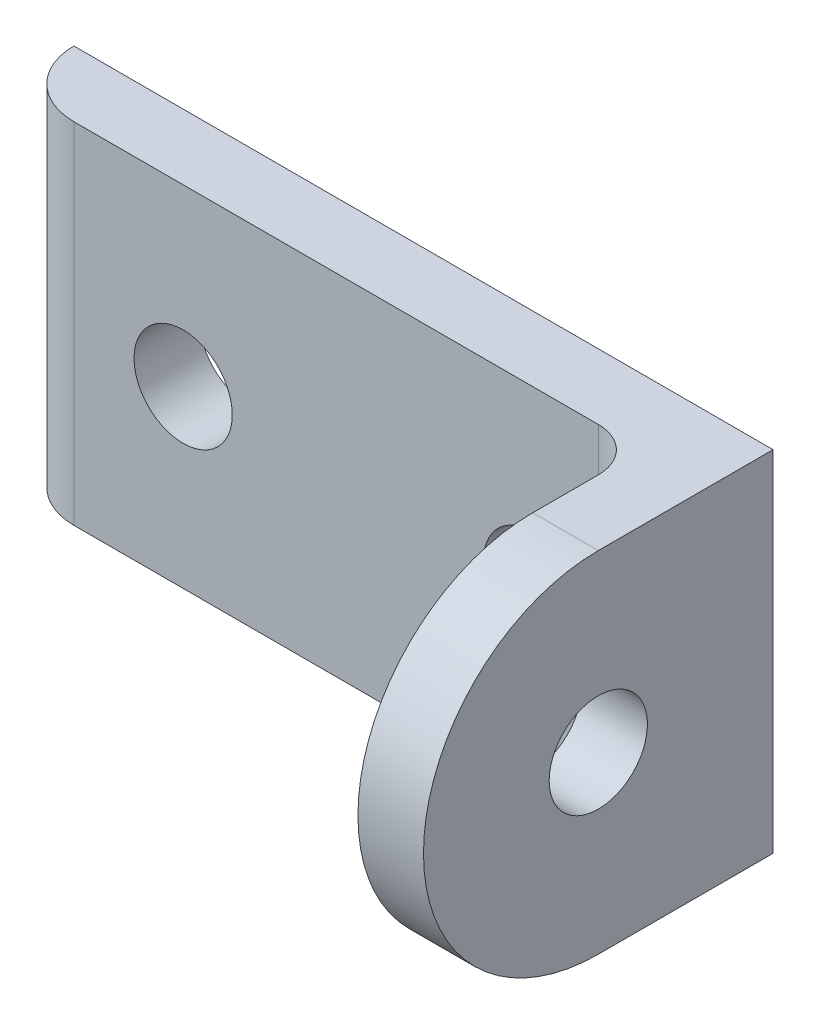
ISO-10303-21;
HEADER;
FILE_DESCRIPTION(('STEP AP214'),'2;1');
FILE_NAME('part.step','',(''),(''),'','','');
FILE_SCHEMA(('AUTOMOTIVE_DESIGN { 1 0 10303 214 1 1 1 1 }'));
ENDSEC;
DATA;
#1=APPLICATION_CONTEXT('core data for automotive mechanical design processes');
#2=APPLICATION_PROTOCOL_DEFINITION('international standard','automotive_design',2000,#1);
#3=PRODUCT_CONTEXT('',#1,'mechanical');
#4=PRODUCT('Part','Part','',(#3));
#5=PRODUCT_RELATED_PRODUCT_CATEGORY('part','',(#4));
#6=PRODUCT_DEFINITION_FORMATION('','',#4);
#7=PRODUCT_DEFINITION_CONTEXT('part definition',#1,'design');
#8=PRODUCT_DEFINITION('design','',#6,#7);
#9=PRODUCT_DEFINITION_SHAPE('','',#8);
#10=(LENGTH_UNIT() NAMED_UNIT(*) SI_UNIT(.MILLI.,.METRE.));
#11=(NAMED_UNIT(*) PLANE_ANGLE_UNIT() SI_UNIT($,.RADIAN.));
#12=(NAMED_UNIT(*) SI_UNIT($,.STERADIAN.) SOLID_ANGLE_UNIT());
#13=UNCERTAINTY_MEASURE_WITH_UNIT(LENGTH_MEASURE(1.E-05),#10,'distance_accuracy_value','');
#14=(GEOMETRIC_REPRESENTATION_CONTEXT(3) GLOBAL_UNCERTAINTY_ASSIGNED_CONTEXT((#13)) GLOBAL_UNIT_ASSIGNED_CONTEXT((#10,
#11,#12)) REPRESENTATION_CONTEXT('',''));
#15=CARTESIAN_POINT('',(0.,0.,0.));
#16=DIRECTION('',(0.,0.,1.));
#17=DIRECTION('',(1.,0.,0.));
#18=AXIS2_PLACEMENT_3D('',#15,#16,#17);
#19=CARTESIAN_POINT('',(-17.2765128060535,-25.4,17.2765128060534));
#20=DIRECTION('',(0.,1.,0.));
#21=DIRECTION('',(0.,0.,1.));
#22=AXIS2_PLACEMENT_3D('',#19,#20,#21);
#23=PLANE('',#22);
#24=DIRECTION('',(-1.,0.,0.));
#25=VECTOR('',#24,1.);
#26=CARTESIAN_POINT('',(-50.8,-25.4,0.));
#27=LINE('',#26,#25);
#28=CARTESIAN_POINT('',(0.,-25.4,0.));
#29=VERTEX_POINT('',#28);
#30=CARTESIAN_POINT('',(-50.8,-25.4,0.));
#31=VERTEX_POINT('',#30);
#32=EDGE_CURVE('E155',#29,#31,#27,.T.);
#33=ORIENTED_EDGE('',*,*,#32,.F.);
#34=DIRECTION('',(0.,0.,-1.));
#35=VECTOR('',#34,1.);
#36=CARTESIAN_POINT('',(0.,-25.4,0.));
#37=LINE('',#36,#35);
#38=CARTESIAN_POINT('',(0.,-25.4,12.7));
#39=VERTEX_POINT('',#38);
#40=EDGE_CURVE('E105',#39,#29,#37,.T.);
#41=ORIENTED_EDGE('',*,*,#40,.F.);
#42=DIRECTION('',(-1.,0.,0.));
#43=VECTOR('',#42,1.);
#44=CARTESIAN_POINT('',(0.,-25.4,12.7));
#45=LINE('',#44,#43);
#46=CARTESIAN_POINT('',(-4.76249999999998,-25.4,12.7));
#47=VERTEX_POINT('',#46);
#48=EDGE_CURVE('E101',#39,#47,#45,.T.);
#49=ORIENTED_EDGE('',*,*,#48,.T.);
#50=DIRECTION('',(0.,0.,-1.));
#51=VECTOR('',#50,1.);
#52=CARTESIAN_POINT('',(-4.76249999999998,-25.4,0.));
#53=LINE('',#52,#51);
#54=CARTESIAN_POINT('',(-4.76249999999998,-25.4,7.93749999999995));
#55=VERTEX_POINT('',#54);
#56=EDGE_CURVE('E115',#47,#55,#53,.T.);
#57=ORIENTED_EDGE('',*,*,#56,.T.);
#58=CARTESIAN_POINT('',(-7.93749999999998,-25.4,7.93749999999995));
#59=DIRECTION('',(0.,1.,0.));
#60=DIRECTION('',(0.,0.,1.));
#61=AXIS2_PLACEMENT_3D('',#58,#59,#60);
#62=CIRCLE('',#61,3.175);
#63=CARTESIAN_POINT('',(-7.93749999999998,-25.4,4.76249999999995));
#64=VERTEX_POINT('',#63);
#65=EDGE_CURVE('E46',#55,#64,#62,.T.);
#66=ORIENTED_EDGE('',*,*,#65,.T.);
#67=DIRECTION('',(-1.,0.,0.));
#68=VECTOR('',#67,1.);
#69=CARTESIAN_POINT('',(-4.76249999999998,-25.4,4.76249999999995));
#70=LINE('',#69,#68);
#71=CARTESIAN_POINT('',(-46.0375,-25.4,4.76249999999995));
#72=VERTEX_POINT('',#71);
#73=EDGE_CURVE('E122',#64,#72,#70,.T.);
#74=ORIENTED_EDGE('',*,*,#73,.T.);
#75=CARTESIAN_POINT('',(-46.0375,-25.4,0.));
#76=DIRECTION('',(0.,1.,0.));
#77=DIRECTION('',(0.,0.,1.));
#78=AXIS2_PLACEMENT_3D('',#75,#76,#77);
#79=CIRCLE('',#78,4.7625);
#80=EDGE_CURVE('E230',#31,#72,#79,.T.);
#81=ORIENTED_EDGE('',*,*,#80,.F.);
#82=EDGE_LOOP('',(#33,#41,#49,#57,#66,#74,#81));
#83=FACE_BOUND('',#82,.T.);
#84=ADVANCED_FACE('F38',(#83),#23,.F.);
#85=CARTESIAN_POINT('',(-50.8,0.,0.));
#86=DIRECTION('',(0.,1.,0.));
#87=DIRECTION('',(0.,0.,1.));
#88=AXIS2_PLACEMENT_3D('',#85,#86,#87);
#89=PLANE('',#88);
#90=CARTESIAN_POINT('',(-46.0375,0.,0.));
#91=DIRECTION('',(0.,1.,0.));
#92=DIRECTION('',(0.,0.,1.));
#93=AXIS2_PLACEMENT_3D('',#90,#91,#92);
#94=CIRCLE('',#93,4.7625);
#95=CARTESIAN_POINT('',(-50.8,0.,0.));
#96=VERTEX_POINT('',#95);
#97=CARTESIAN_POINT('',(-46.0375,0.,4.76249999999996));
#98=VERTEX_POINT('',#97);
#99=EDGE_CURVE('E227',#96,#98,#94,.T.);
#100=ORIENTED_EDGE('',*,*,#99,.T.);
#101=DIRECTION('',(-1.,0.,0.));
#102=VECTOR('',#101,1.);
#103=CARTESIAN_POINT('',(-4.76249999999998,0.,4.76249999999995));
#104=LINE('',#103,#102);
#105=CARTESIAN_POINT('',(-7.93749999999998,0.,4.76249999999995));
#106=VERTEX_POINT('',#105);
#107=EDGE_CURVE('E124',#106,#98,#104,.T.);
#108=ORIENTED_EDGE('',*,*,#107,.F.);
#109=CARTESIAN_POINT('',(-7.93749999999998,0.,7.93749999999995));
#110=DIRECTION('',(0.,1.,0.));
#111=DIRECTION('',(0.,0.,1.));
#112=AXIS2_PLACEMENT_3D('',#109,#110,#111);
#113=CIRCLE('',#112,3.175);
#114=CARTESIAN_POINT('',(-4.76249999999998,0.,7.93749999999996));
#115=VERTEX_POINT('',#114);
#116=EDGE_CURVE('E12',#106,#115,#113,.F.);
#117=ORIENTED_EDGE('',*,*,#116,.T.);
#118=DIRECTION('',(0.,0.,1.));
#119=VECTOR('',#118,1.);
#120=CARTESIAN_POINT('',(-4.76249999999998,0.,12.7));
#121=LINE('',#120,#119);
#122=CARTESIAN_POINT('',(-4.76249999999998,0.,12.7));
#123=VERTEX_POINT('',#122);
#124=EDGE_CURVE('E120',#115,#123,#121,.T.);
#125=ORIENTED_EDGE('',*,*,#124,.T.);
#126=DIRECTION('',(-1.,0.,0.));
#127=VECTOR('',#126,1.);
#128=CARTESIAN_POINT('',(0.,0.,12.7));
#129=LINE('',#128,#127);
#130=CARTESIAN_POINT('',(0.,0.,12.7));
#131=VERTEX_POINT('',#130);
#132=EDGE_CURVE('E99',#131,#123,#129,.T.);
#133=ORIENTED_EDGE('',*,*,#132,.F.);
#134=DIRECTION('',(0.,0.,1.));
#135=VECTOR('',#134,1.);
#136=CARTESIAN_POINT('',(0.,0.,12.7));
#137=LINE('',#136,#135);
#138=CARTESIAN_POINT('',(0.,0.,0.));
#139=VERTEX_POINT('',#138);
#140=EDGE_CURVE('E106',#139,#131,#137,.T.);
#141=ORIENTED_EDGE('',*,*,#140,.F.);
#142=DIRECTION('',(-1.,0.,0.));
#143=VECTOR('',#142,1.);
#144=CARTESIAN_POINT('',(-50.8,0.,0.));
#145=LINE('',#144,#143);
#146=EDGE_CURVE('E148',#96,#139,#145,.F.);
#147=ORIENTED_EDGE('',*,*,#146,.F.);
#148=EDGE_LOOP('',(#100,#108,#117,#125,#133,#141,#147));
#149=FACE_BOUND('',#148,.T.);
#150=ADVANCED_FACE('F118',(#149),#89,.T.);
#151=CARTESIAN_POINT('',(-50.8,-25.4,0.));
#152=DIRECTION('',(0.,0.,-1.));
#153=DIRECTION('',(-1.,0.,0.));
#154=AXIS2_PLACEMENT_3D('',#151,#152,#153);
#155=PLANE('',#154);
#156=CARTESIAN_POINT('',(-38.1,-12.7,0.));
#157=DIRECTION('',(0.,0.,-1.));
#158=DIRECTION('',(0.,1.,0.));
#159=AXIS2_PLACEMENT_3D('',#156,#157,#158);
#160=CIRCLE('',#159,3.56869999999999);
#161=CARTESIAN_POINT('',(-38.1,-9.13130000000004,0.));
#162=VERTEX_POINT('',#161);
#163=EDGE_CURVE('E168',#162,#162,#160,.T.);
#164=ORIENTED_EDGE('',*,*,#163,.F.);
#165=EDGE_LOOP('',(#164));
#166=FACE_BOUND('',#165,.T.);
#167=CARTESIAN_POINT('',(-12.7,-12.7,0.));
#168=DIRECTION('',(0.,0.,-1.));
#169=DIRECTION('',(0.,1.,0.));
#170=AXIS2_PLACEMENT_3D('',#167,#168,#169);
#171=CIRCLE('',#170,3.56869999999999);
#172=CARTESIAN_POINT('',(-12.7,-9.13130000000003,0.));
#173=VERTEX_POINT('',#172);
#174=EDGE_CURVE('E160',#173,#173,#171,.T.);
#175=ORIENTED_EDGE('',*,*,#174,.F.);
#176=EDGE_LOOP('',(#175));
#177=FACE_BOUND('',#176,.T.);
#178=ORIENTED_EDGE('',*,*,#146,.T.);
#179=DIRECTION('',(0.,1.,0.));
#180=VECTOR('',#179,1.);
#181=CARTESIAN_POINT('',(0.,0.,0.));
#182=LINE('',#181,#180);
#183=EDGE_CURVE('E112',#29,#139,#182,.T.);
#184=ORIENTED_EDGE('',*,*,#183,.F.);
#185=ORIENTED_EDGE('',*,*,#32,.T.);
#186=DIRECTION('',(0.,1.,0.));
#187=VECTOR('',#186,1.);
#188=CARTESIAN_POINT('',(-50.8,-25.4,0.));
#189=LINE('',#188,#187);
#190=EDGE_CURVE('E131',#31,#96,#189,.T.);
#191=ORIENTED_EDGE('',*,*,#190,.T.);
#192=EDGE_LOOP('',(#178,#184,#185,#191));
#193=FACE_BOUND('',#192,.T.);
#194=ADVANCED_FACE('F172',(#166,#177,#193),#155,.T.);
#195=CARTESIAN_POINT('',(-46.0375,-25.4,0.));
#196=DIRECTION('',(0.,1.,0.));
#197=DIRECTION('',(0.,0.,1.));
#198=AXIS2_PLACEMENT_3D('',#195,#196,#197);
#199=CYLINDRICAL_SURFACE('',#198,4.7625);
#200=ORIENTED_EDGE('',*,*,#99,.F.);
#201=ORIENTED_EDGE('',*,*,#190,.F.);
#202=ORIENTED_EDGE('',*,*,#80,.T.);
#203=DIRECTION('',(0.,1.,0.));
#204=VECTOR('',#203,1.);
#205=CARTESIAN_POINT('',(-46.0375,-25.4,4.76249999999995));
#206=LINE('',#205,#204);
#207=EDGE_CURVE('E184',#72,#98,#206,.T.);
#208=ORIENTED_EDGE('',*,*,#207,.T.);
#209=EDGE_LOOP('',(#200,#201,#202,#208));
#210=FACE_BOUND('',#209,.T.);
#211=ADVANCED_FACE('F255',(#210),#199,.T.);
#212=CARTESIAN_POINT('',(-4.76249999999998,-25.4,4.76249999999995));
#213=DIRECTION('',(0.,0.,-1.));
#214=DIRECTION('',(-1.,0.,0.));
#215=AXIS2_PLACEMENT_3D('',#212,#213,#214);
#216=PLANE('',#215);
#217=CARTESIAN_POINT('',(-38.1,-12.7,4.76249999999995));
#218=DIRECTION('',(0.,0.,-1.));
#219=DIRECTION('',(-1.,0.,0.));
#220=AXIS2_PLACEMENT_3D('',#217,#218,#219);
#221=CIRCLE('',#220,3.56869999999999);
#222=CARTESIAN_POINT('',(-41.6687,-12.7,4.76249999999995));
#223=VERTEX_POINT('',#222);
#224=EDGE_CURVE('E144',#223,#223,#221,.T.);
#225=ORIENTED_EDGE('',*,*,#224,.T.);
#226=EDGE_LOOP('',(#225));
#227=FACE_BOUND('',#226,.T.);
#228=CARTESIAN_POINT('',(-12.7,-12.7,4.76249999999995));
#229=DIRECTION('',(0.,0.,-1.));
#230=DIRECTION('',(-1.,0.,0.));
#231=AXIS2_PLACEMENT_3D('',#228,#229,#230);
#232=CIRCLE('',#231,3.56869999999999);
#233=CARTESIAN_POINT('',(-16.2687,-12.7,4.76249999999995));
#234=VERTEX_POINT('',#233);
#235=EDGE_CURVE('E143',#234,#234,#232,.T.);
#236=ORIENTED_EDGE('',*,*,#235,.T.);
#237=EDGE_LOOP('',(#236));
#238=FACE_BOUND('',#237,.T.);
#239=ORIENTED_EDGE('',*,*,#73,.F.);
#240=DIRECTION('',(0.,-1.,0.));
#241=VECTOR('',#240,1.);
#242=CARTESIAN_POINT('',(-7.93749999999998,-25.4,4.76249999999995));
#243=LINE('',#242,#241);
#244=EDGE_CURVE('E53',#64,#106,#243,.F.);
#245=ORIENTED_EDGE('',*,*,#244,.T.);
#246=ORIENTED_EDGE('',*,*,#107,.T.);
#247=ORIENTED_EDGE('',*,*,#207,.F.);
#248=EDGE_LOOP('',(#239,#245,#246,#247));
#249=FACE_BOUND('',#248,.T.);
#250=ADVANCED_FACE('F253',(#227,#238,#249),#216,.F.);
#251=CARTESIAN_POINT('',(0.,-12.7,12.7));
#252=DIRECTION('',(-1.,0.,0.));
#253=DIRECTION('',(0.,0.,1.));
#254=AXIS2_PLACEMENT_3D('',#251,#252,#253);
#255=CYLINDRICAL_SURFACE('',#254,12.7);
#256=CARTESIAN_POINT('',(-4.76249999999998,-12.7,12.7));
#257=DIRECTION('',(1.,0.,0.));
#258=DIRECTION('',(0.,0.,1.));
#259=AXIS2_PLACEMENT_3D('',#256,#257,#258);
#260=CIRCLE('',#259,12.7);
#261=EDGE_CURVE('E130',#123,#47,#260,.T.);
#262=ORIENTED_EDGE('',*,*,#261,.T.);
#263=ORIENTED_EDGE('',*,*,#48,.F.);
#264=CARTESIAN_POINT('',(0.,-12.7,12.7));
#265=DIRECTION('',(1.,0.,0.));
#266=DIRECTION('',(0.,0.,1.));
#267=AXIS2_PLACEMENT_3D('',#264,#265,#266);
#268=CIRCLE('',#267,12.7);
#269=EDGE_CURVE('E95',#131,#39,#268,.T.);
#270=ORIENTED_EDGE('',*,*,#269,.F.);
#271=ORIENTED_EDGE('',*,*,#132,.T.);
#272=EDGE_LOOP('',(#262,#263,#270,#271));
#273=FACE_BOUND('',#272,.T.);
#274=ADVANCED_FACE('F97',(#273),#255,.T.);
#275=CARTESIAN_POINT('',(0.,-12.7,12.7));
#276=DIRECTION('',(-1.,0.,0.));
#277=DIRECTION('',(0.,0.,1.));
#278=AXIS2_PLACEMENT_3D('',#275,#276,#277);
#279=PLANE('',#278);
#280=CARTESIAN_POINT('',(0.,-12.7,12.7));
#281=DIRECTION('',(-1.,0.,0.));
#282=DIRECTION('',(0.,0.,1.));
#283=AXIS2_PLACEMENT_3D('',#280,#281,#282);
#284=CIRCLE('',#283,3.56869999999999);
#285=CARTESIAN_POINT('',(0.,-12.7,16.2687));
#286=VERTEX_POINT('',#285);
#287=EDGE_CURVE('E383',#286,#286,#284,.T.);
#288=ORIENTED_EDGE('',*,*,#287,.T.);
#289=EDGE_LOOP('',(#288));
#290=FACE_BOUND('',#289,.T.);
#291=ORIENTED_EDGE('',*,*,#140,.T.);
#292=ORIENTED_EDGE('',*,*,#269,.T.);
#293=ORIENTED_EDGE('',*,*,#40,.T.);
#294=ORIENTED_EDGE('',*,*,#183,.T.);
#295=EDGE_LOOP('',(#291,#292,#293,#294));
#296=FACE_BOUND('',#295,.T.);
#297=ADVANCED_FACE('F110',(#290,#296),#279,.F.);
#298=CARTESIAN_POINT('',(-4.76249999999998,-12.7,12.7));
#299=DIRECTION('',(-1.,0.,0.));
#300=DIRECTION('',(0.,0.,1.));
#301=AXIS2_PLACEMENT_3D('',#298,#299,#300);
#302=PLANE('',#301);
#303=CARTESIAN_POINT('',(-4.76249999999998,-12.7,12.7));
#304=DIRECTION('',(-1.,0.,0.));
#305=DIRECTION('',(0.,0.,1.));
#306=AXIS2_PLACEMENT_3D('',#303,#304,#305);
#307=CIRCLE('',#306,3.56869999999999);
#308=CARTESIAN_POINT('',(-4.76249999999998,-12.7,16.2687));
#309=VERTEX_POINT('',#308);
#310=EDGE_CURVE('E384',#309,#309,#307,.T.);
#311=ORIENTED_EDGE('',*,*,#310,.F.);
#312=EDGE_LOOP('',(#311));
#313=FACE_BOUND('',#312,.T.);
#314=ORIENTED_EDGE('',*,*,#124,.F.);
#315=DIRECTION('',(0.,-1.,0.));
#316=VECTOR('',#315,1.);
#317=CARTESIAN_POINT('',(-4.76249999999998,-12.7,7.93749999999995));
#318=LINE('',#317,#316);
#319=EDGE_CURVE('E146',#115,#55,#318,.T.);
#320=ORIENTED_EDGE('',*,*,#319,.T.);
#321=ORIENTED_EDGE('',*,*,#56,.F.);
#322=ORIENTED_EDGE('',*,*,#261,.F.);
#323=EDGE_LOOP('',(#314,#320,#321,#322));
#324=FACE_BOUND('',#323,.T.);
#325=ADVANCED_FACE('F318',(#313,#324),#302,.T.);
#326=CARTESIAN_POINT('',(-12.7,-12.7,0.));
#327=DIRECTION('',(0.,0.,-1.));
#328=DIRECTION('',(0.,1.,0.));
#329=AXIS2_PLACEMENT_3D('',#326,#327,#328);
#330=CYLINDRICAL_SURFACE('',#329,3.56869999999999);
#331=ORIENTED_EDGE('',*,*,#174,.T.);
#332=EDGE_LOOP('',(#331));
#333=FACE_BOUND('',#332,.T.);
#334=ORIENTED_EDGE('',*,*,#235,.F.);
#335=EDGE_LOOP('',(#334));
#336=FACE_BOUND('',#335,.T.);
#337=ADVANCED_FACE('F323',(#333,#336),#330,.F.);
#338=CARTESIAN_POINT('',(-38.1,-12.7,0.));
#339=DIRECTION('',(0.,0.,-1.));
#340=DIRECTION('',(0.,1.,0.));
#341=AXIS2_PLACEMENT_3D('',#338,#339,#340);
#342=CYLINDRICAL_SURFACE('',#341,3.56869999999999);
#343=ORIENTED_EDGE('',*,*,#163,.T.);
#344=EDGE_LOOP('',(#343));
#345=FACE_BOUND('',#344,.T.);
#346=ORIENTED_EDGE('',*,*,#224,.F.);
#347=EDGE_LOOP('',(#346));
#348=FACE_BOUND('',#347,.T.);
#349=ADVANCED_FACE('F346',(#345,#348),#342,.F.);
#350=CARTESIAN_POINT('',(-4.76249999999998,-12.7,12.7));
#351=DIRECTION('',(-1.,0.,0.));
#352=DIRECTION('',(0.,0.,1.));
#353=AXIS2_PLACEMENT_3D('',#350,#351,#352);
#354=CYLINDRICAL_SURFACE('',#353,3.56869999999999);
#355=ORIENTED_EDGE('',*,*,#287,.F.);
#356=EDGE_LOOP('',(#355));
#357=FACE_BOUND('',#356,.T.);
#358=ORIENTED_EDGE('',*,*,#310,.T.);
#359=EDGE_LOOP('',(#358));
#360=FACE_BOUND('',#359,.T.);
#361=ADVANCED_FACE('F336',(#357,#360),#354,.F.);
#362=CARTESIAN_POINT('',(-7.93749999999998,-12.7,7.93749999999995));
#363=DIRECTION('',(0.,-1.,0.));
#364=DIRECTION('',(0.,0.,-1.));
#365=AXIS2_PLACEMENT_3D('',#362,#363,#364);
#366=CYLINDRICAL_SURFACE('',#365,3.175);
#367=ORIENTED_EDGE('',*,*,#116,.F.);
#368=ORIENTED_EDGE('',*,*,#244,.F.);
#369=ORIENTED_EDGE('',*,*,#65,.F.);
#370=ORIENTED_EDGE('',*,*,#319,.F.);
#371=EDGE_LOOP('',(#367,#368,#369,#370));
#372=FACE_BOUND('',#371,.T.);
#373=ADVANCED_FACE('F40',(#372),#366,.F.);
#374=CLOSED_SHELL('',(#84,#150,#194,#211,#250,#274,#297,#325,#337,#349,#361,#373));
#375=MANIFOLD_SOLID_BREP('B2',#374);
#376=ADVANCED_BREP_SHAPE_REPRESENTATION('',(#18,#375),#14);
#377=SHAPE_DEFINITION_REPRESENTATION(#9,#376);
ENDSEC;
END-ISO-10303-21;
